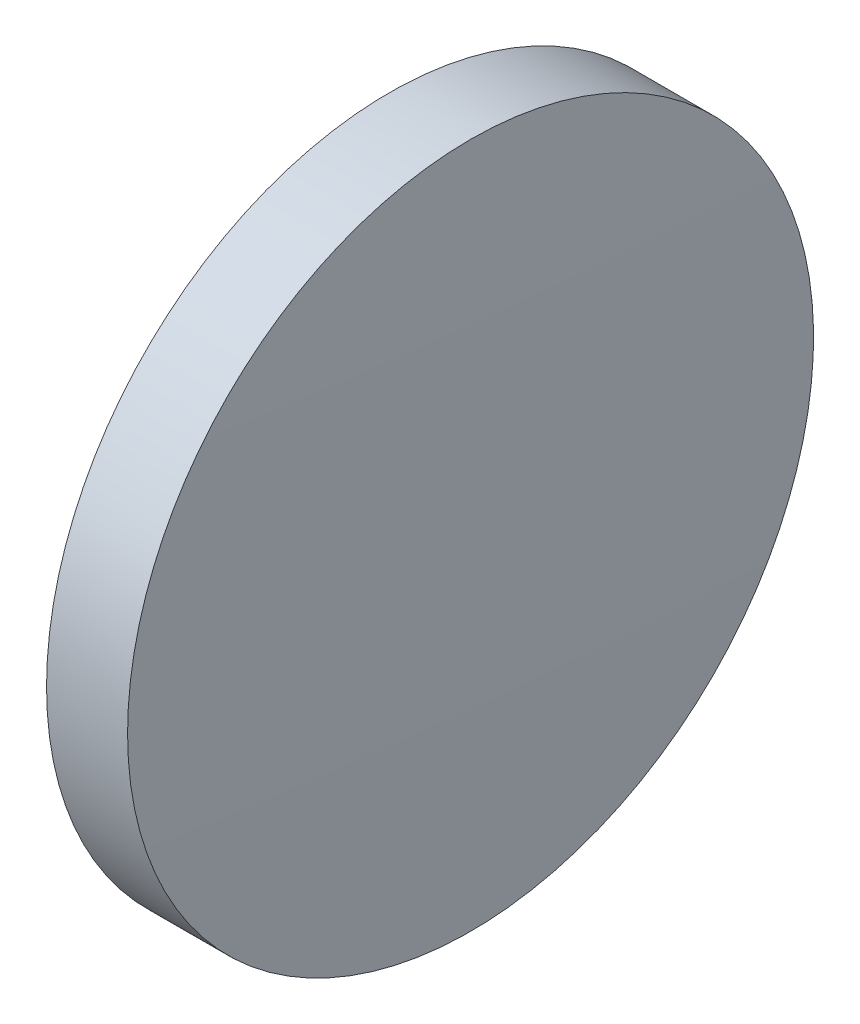
ISO-10303-21;
HEADER;
FILE_DESCRIPTION(('STEP AP214'),'2;1');
FILE_NAME('part.step','',(''),(''),'','','');
FILE_SCHEMA(('AUTOMOTIVE_DESIGN { 1 0 10303 214 1 1 1 1 }'));
ENDSEC;
DATA;
#1=APPLICATION_CONTEXT('core data for automotive mechanical design processes');
#2=APPLICATION_PROTOCOL_DEFINITION('international standard','automotive_design',2000,#1);
#3=PRODUCT_CONTEXT('',#1,'mechanical');
#4=PRODUCT('Part','Part','',(#3));
#5=PRODUCT_RELATED_PRODUCT_CATEGORY('part','',(#4));
#6=PRODUCT_DEFINITION_FORMATION('','',#4);
#7=PRODUCT_DEFINITION_CONTEXT('part definition',#1,'design');
#8=PRODUCT_DEFINITION('design','',#6,#7);
#9=PRODUCT_DEFINITION_SHAPE('','',#8);
#10=(LENGTH_UNIT() NAMED_UNIT(*) SI_UNIT(.MILLI.,.METRE.));
#11=(NAMED_UNIT(*) PLANE_ANGLE_UNIT() SI_UNIT($,.RADIAN.));
#12=(NAMED_UNIT(*) SI_UNIT($,.STERADIAN.) SOLID_ANGLE_UNIT());
#13=UNCERTAINTY_MEASURE_WITH_UNIT(LENGTH_MEASURE(1.E-05),#10,'distance_accuracy_value','');
#14=(GEOMETRIC_REPRESENTATION_CONTEXT(3) GLOBAL_UNCERTAINTY_ASSIGNED_CONTEXT((#13)) GLOBAL_UNIT_ASSIGNED_CONTEXT((#10,
#11,#12)) REPRESENTATION_CONTEXT('',''));
#15=CARTESIAN_POINT('',(0.,0.,0.));
#16=DIRECTION('',(0.,0.,1.));
#17=DIRECTION('',(1.,0.,0.));
#18=AXIS2_PLACEMENT_3D('',#15,#16,#17);
#19=CARTESIAN_POINT('',(-340.050393569162,65.2335549264122,0.));
#20=DIRECTION('',(-1.,0.,0.));
#21=DIRECTION('',(0.,1.,0.));
#22=AXIS2_PLACEMENT_3D('',#19,#20,#21);
#23=SPHERICAL_SURFACE('',#22,459.);
#24=CARTESIAN_POINT('',(118.773875623304,65.2335549264122,0.));
#25=DIRECTION('',(-1.,0.,0.));
#26=DIRECTION('',(0.,0.,1.));
#27=AXIS2_PLACEMENT_3D('',#24,#25,#26);
#28=CIRCLE('',#27,12.7);
#29=CARTESIAN_POINT('',(118.773875623304,65.2335549264122,12.7));
#30=VERTEX_POINT('',#29);
#31=EDGE_CURVE('E10',#30,#30,#28,.T.);
#32=ORIENTED_EDGE('',*,*,#31,.F.);
#33=EDGE_LOOP('',(#32));
#34=FACE_BOUND('',#33,.T.);
#35=ADVANCED_FACE('F35',(#34),#23,.T.);
#36=CARTESIAN_POINT('',(110.165373228488,65.2335549264122,0.));
#37=DIRECTION('',(-1.,0.,0.));
#38=DIRECTION('',(0.,0.,1.));
#39=AXIS2_PLACEMENT_3D('',#36,#37,#38);
#40=CYLINDRICAL_SURFACE('',#39,12.7);
#41=CARTESIAN_POINT('',(115.773606430838,65.2335549264122,0.));
#42=DIRECTION('',(-1.,0.,0.));
#43=DIRECTION('',(0.,0.,1.));
#44=AXIS2_PLACEMENT_3D('',#41,#42,#43);
#45=CIRCLE('',#44,12.7);
#46=CARTESIAN_POINT('',(115.773606430838,65.2335549264122,12.7));
#47=VERTEX_POINT('',#46);
#48=EDGE_CURVE('E41',#47,#47,#45,.T.);
#49=ORIENTED_EDGE('',*,*,#48,.F.);
#50=EDGE_LOOP('',(#49));
#51=FACE_BOUND('',#50,.T.);
#52=ORIENTED_EDGE('',*,*,#31,.T.);
#53=EDGE_LOOP('',(#52));
#54=FACE_BOUND('',#53,.T.);
#55=ADVANCED_FACE('F49',(#51,#54),#40,.T.);
#56=CARTESIAN_POINT('',(115.773606430838,65.2335549264122,0.));
#57=DIRECTION('',(1.,0.,0.));
#58=DIRECTION('',(0.,0.,-1.));
#59=AXIS2_PLACEMENT_3D('',#56,#57,#58);
#60=PLANE('',#59);
#61=ORIENTED_EDGE('',*,*,#48,.T.);
#62=EDGE_LOOP('',(#61));
#63=FACE_BOUND('',#62,.T.);
#64=ADVANCED_FACE('F47',(#63),#60,.F.);
#65=CLOSED_SHELL('',(#35,#55,#64));
#66=MANIFOLD_SOLID_BREP('B2',#65);
#67=ADVANCED_BREP_SHAPE_REPRESENTATION('',(#18,#66),#14);
#68=SHAPE_DEFINITION_REPRESENTATION(#9,#67);
ENDSEC;
END-ISO-10303-21;
